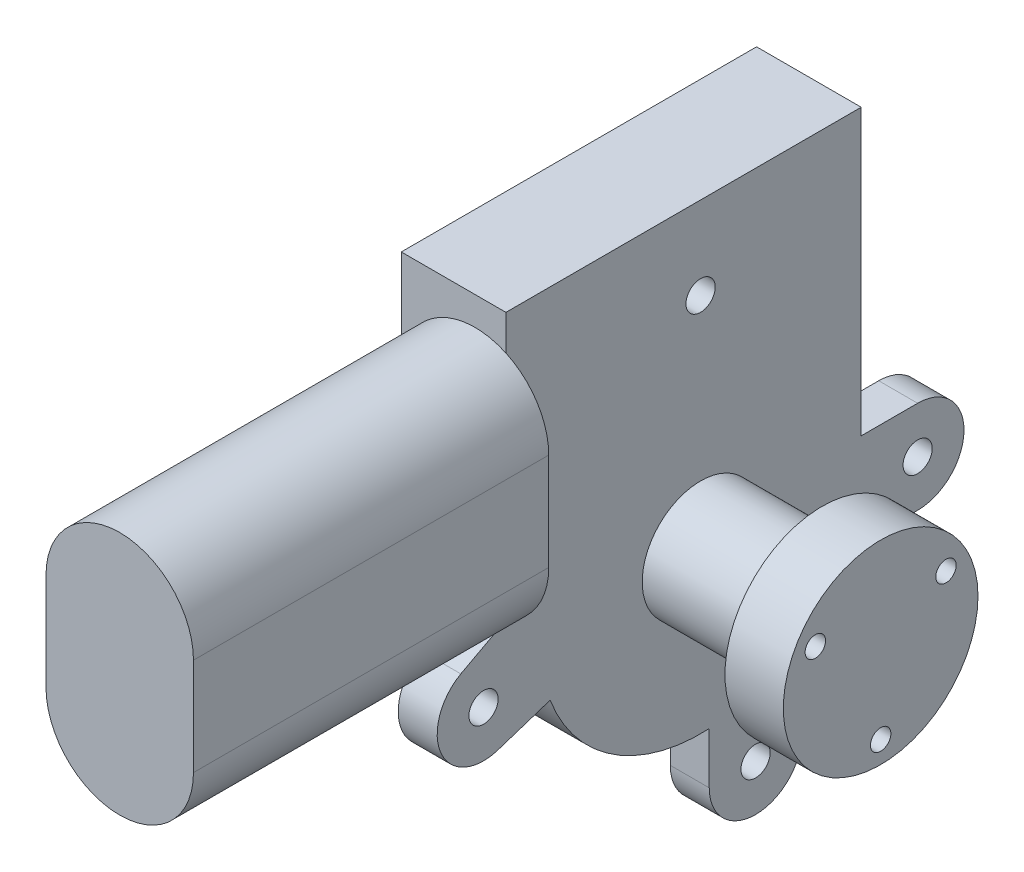
ISO-10303-21;
HEADER;
FILE_DESCRIPTION(('STEP AP214'),'2;1');
FILE_NAME('part.step','',(''),(''),'','','');
FILE_SCHEMA(('AUTOMOTIVE_DESIGN { 1 0 10303 214 1 1 1 1 }'));
ENDSEC;
DATA;
#1=APPLICATION_CONTEXT('core data for automotive mechanical design processes');
#2=APPLICATION_PROTOCOL_DEFINITION('international standard','automotive_design',2000,#1);
#3=PRODUCT_CONTEXT('',#1,'mechanical');
#4=PRODUCT('Part','Part','',(#3));
#5=PRODUCT_RELATED_PRODUCT_CATEGORY('part','',(#4));
#6=PRODUCT_DEFINITION_FORMATION('','',#4);
#7=PRODUCT_DEFINITION_CONTEXT('part definition',#1,'design');
#8=PRODUCT_DEFINITION('design','',#6,#7);
#9=PRODUCT_DEFINITION_SHAPE('','',#8);
#10=(LENGTH_UNIT() NAMED_UNIT(*) SI_UNIT(.MILLI.,.METRE.));
#11=(NAMED_UNIT(*) PLANE_ANGLE_UNIT() SI_UNIT($,.RADIAN.));
#12=(NAMED_UNIT(*) SI_UNIT($,.STERADIAN.) SOLID_ANGLE_UNIT());
#13=UNCERTAINTY_MEASURE_WITH_UNIT(LENGTH_MEASURE(1.E-05),#10,'distance_accuracy_value','');
#14=(GEOMETRIC_REPRESENTATION_CONTEXT(3) GLOBAL_UNCERTAINTY_ASSIGNED_CONTEXT((#13)) GLOBAL_UNIT_ASSIGNED_CONTEXT((#10,
#11,#12)) REPRESENTATION_CONTEXT('',''));
#15=CARTESIAN_POINT('',(0.,0.,0.));
#16=DIRECTION('',(0.,0.,1.));
#17=DIRECTION('',(1.,0.,0.));
#18=AXIS2_PLACEMENT_3D('',#15,#16,#17);
#19=CARTESIAN_POINT('',(0.,0.,73.));
#20=DIRECTION('',(0.,1.,0.));
#21=DIRECTION('',(0.,0.,1.));
#22=AXIS2_PLACEMENT_3D('',#19,#20,#21);
#23=PLANE('',#22);
#24=DIRECTION('',(0.,0.,-1.));
#25=VECTOR('',#24,1.);
#26=CARTESIAN_POINT('',(13.5,0.,73.));
#27=LINE('',#26,#25);
#28=CARTESIAN_POINT('',(13.5,0.,73.));
#29=VERTEX_POINT('',#28);
#30=CARTESIAN_POINT('',(13.5,0.,66.));
#31=VERTEX_POINT('',#30);
#32=EDGE_CURVE('E247',#29,#31,#27,.T.);
#33=ORIENTED_EDGE('',*,*,#32,.F.);
#34=DIRECTION('',(1.,0.,0.));
#35=VECTOR('',#34,1.);
#36=CARTESIAN_POINT('',(0.,0.,73.));
#37=LINE('',#36,#35);
#38=CARTESIAN_POINT('',(0.,0.,73.));
#39=VERTEX_POINT('',#38);
#40=EDGE_CURVE('E341',#39,#29,#37,.T.);
#41=ORIENTED_EDGE('',*,*,#40,.F.);
#42=DIRECTION('',(0.,0.,-1.));
#43=VECTOR('',#42,1.);
#44=CARTESIAN_POINT('',(0.,0.,73.));
#45=LINE('',#44,#43);
#46=CARTESIAN_POINT('',(0.,0.,66.));
#47=VERTEX_POINT('',#46);
#48=EDGE_CURVE('E365',#39,#47,#45,.T.);
#49=ORIENTED_EDGE('',*,*,#48,.T.);
#50=DIRECTION('',(-1.,0.,0.));
#51=VECTOR('',#50,1.);
#52=CARTESIAN_POINT('',(21.5,0.,66.));
#53=LINE('',#52,#51);
#54=EDGE_CURVE('E368',#47,#31,#53,.F.);
#55=ORIENTED_EDGE('',*,*,#54,.T.);
#56=EDGE_LOOP('',(#33,#41,#49,#55));
#57=FACE_BOUND('',#56,.T.);
#58=ADVANCED_FACE('F39',(#57),#23,.F.);
#59=CARTESIAN_POINT('',(0.,0.,73.));
#60=DIRECTION('',(0.,0.,-1.));
#61=DIRECTION('',(-1.,0.,0.));
#62=AXIS2_PLACEMENT_3D('',#59,#60,#61);
#63=PLANE('',#62);
#64=DIRECTION('',(0.,-1.,0.));
#65=VECTOR('',#64,1.);
#66=CARTESIAN_POINT('',(13.5,0.,73.));
#67=LINE('',#66,#65);
#68=CARTESIAN_POINT('',(13.5,5.94011952238664,73.));
#69=VERTEX_POINT('',#68);
#70=EDGE_CURVE('E241',#69,#29,#67,.T.);
#71=ORIENTED_EDGE('',*,*,#70,.F.);
#72=CARTESIAN_POINT('',(15.15,21.,73.));
#73=DIRECTION('',(0.,0.,1.));
#74=DIRECTION('',(1.,0.,0.));
#75=AXIS2_PLACEMENT_3D('',#72,#73,#74);
#76=CIRCLE('',#75,15.15);
#77=CARTESIAN_POINT('',(0.,21.,73.));
#78=VERTEX_POINT('',#77);
#79=EDGE_CURVE('E324',#78,#69,#76,.T.);
#80=ORIENTED_EDGE('',*,*,#79,.F.);
#81=DIRECTION('',(0.,-1.,0.));
#82=VECTOR('',#81,1.);
#83=CARTESIAN_POINT('',(0.,0.,73.));
#84=LINE('',#83,#82);
#85=EDGE_CURVE('E342',#78,#39,#84,.T.);
#86=ORIENTED_EDGE('',*,*,#85,.T.);
#87=ORIENTED_EDGE('',*,*,#40,.T.);
#88=EDGE_LOOP('',(#71,#80,#86,#87));
#89=FACE_BOUND('',#88,.T.);
#90=ADVANCED_FACE('F427',(#89),#63,.F.);
#91=CARTESIAN_POINT('',(15.15,41.,73.));
#92=DIRECTION('',(0.,0.,1.));
#93=DIRECTION('',(1.,0.,0.));
#94=AXIS2_PLACEMENT_3D('',#91,#92,#93);
#95=CIRCLE('',#94,15.15);
#96=CARTESIAN_POINT('',(21.5,54.7549990912395,73.));
#97=VERTEX_POINT('',#96);
#98=CARTESIAN_POINT('',(0.,41.,73.));
#99=VERTEX_POINT('',#98);
#100=EDGE_CURVE('E323',#97,#99,#95,.T.);
#101=ORIENTED_EDGE('',*,*,#100,.F.);
#102=DIRECTION('',(0.,1.,0.));
#103=VECTOR('',#102,1.);
#104=CARTESIAN_POINT('',(21.5,0.,73.));
#105=LINE('',#104,#103);
#106=CARTESIAN_POINT('',(21.5,62.,73.));
#107=VERTEX_POINT('',#106);
#108=EDGE_CURVE('E345',#97,#107,#105,.T.);
#109=ORIENTED_EDGE('',*,*,#108,.T.);
#110=DIRECTION('',(-1.,0.,0.));
#111=VECTOR('',#110,1.);
#112=CARTESIAN_POINT('',(0.,62.,73.));
#113=LINE('',#112,#111);
#114=CARTESIAN_POINT('',(0.,62.,73.));
#115=VERTEX_POINT('',#114);
#116=EDGE_CURVE('E348',#107,#115,#113,.T.);
#117=ORIENTED_EDGE('',*,*,#116,.T.);
#118=EDGE_CURVE('E339',#115,#99,#84,.T.);
#119=ORIENTED_EDGE('',*,*,#118,.T.);
#120=EDGE_LOOP('',(#101,#109,#117,#119));
#121=FACE_BOUND('',#120,.T.);
#122=ADVANCED_FACE('F449',(#121),#63,.F.);
#123=CARTESIAN_POINT('',(21.5,0.,33.));
#124=DIRECTION('',(-1.,0.,0.));
#125=DIRECTION('',(0.,0.,1.));
#126=AXIS2_PLACEMENT_3D('',#123,#124,#125);
#127=CYLINDRICAL_SURFACE('',#126,33.);
#128=CARTESIAN_POINT('',(21.5,0.,33.));
#129=DIRECTION('',(1.,0.,0.));
#130=DIRECTION('',(0.,0.,-1.));
#131=AXIS2_PLACEMENT_3D('',#128,#129,#130);
#132=CIRCLE('',#131,33.);
#133=CARTESIAN_POINT('',(21.5,-11.5557475374894,63.9105920171356));
#134=VERTEX_POINT('',#133);
#135=CARTESIAN_POINT('',(21.5,-32.9522286803184,31.225));
#136=VERTEX_POINT('',#135);
#137=EDGE_CURVE('E60',#134,#136,#132,.T.);
#138=ORIENTED_EDGE('',*,*,#137,.F.);
#139=DIRECTION('',(1.,0.,0.));
#140=VECTOR('',#139,1.);
#141=CARTESIAN_POINT('',(13.5,-11.5557475374894,63.9105920171356));
#142=LINE('',#141,#140);
#143=CARTESIAN_POINT('',(13.5,-11.5557475374894,63.9105920171356));
#144=VERTEX_POINT('',#143);
#145=EDGE_CURVE('E55',#144,#134,#142,.T.);
#146=ORIENTED_EDGE('',*,*,#145,.F.);
#147=CARTESIAN_POINT('',(13.5,0.,33.));
#148=DIRECTION('',(1.,0.,0.));
#149=DIRECTION('',(0.,0.,-1.));
#150=AXIS2_PLACEMENT_3D('',#147,#148,#149);
#151=CIRCLE('',#150,33.);
#152=EDGE_CURVE('E250',#31,#144,#151,.T.);
#153=ORIENTED_EDGE('',*,*,#152,.F.);
#154=ORIENTED_EDGE('',*,*,#54,.F.);
#155=CARTESIAN_POINT('',(0.,0.,33.));
#156=DIRECTION('',(1.,0.,0.));
#157=DIRECTION('',(0.,0.,-1.));
#158=AXIS2_PLACEMENT_3D('',#155,#156,#157);
#159=CIRCLE('',#158,33.);
#160=CARTESIAN_POINT('',(0.,0.,0.));
#161=VERTEX_POINT('',#160);
#162=EDGE_CURVE('E374',#47,#161,#159,.T.);
#163=ORIENTED_EDGE('',*,*,#162,.T.);
#164=DIRECTION('',(1.,0.,0.));
#165=VECTOR('',#164,1.);
#166=CARTESIAN_POINT('',(0.,0.,0.));
#167=LINE('',#166,#165);
#168=CARTESIAN_POINT('',(13.5,0.,0.));
#169=VERTEX_POINT('',#168);
#170=EDGE_CURVE('E353',#161,#169,#167,.T.);
#171=ORIENTED_EDGE('',*,*,#170,.T.);
#172=CARTESIAN_POINT('',(13.5,0.,33.));
#173=DIRECTION('',(-1.,0.,0.));
#174=DIRECTION('',(0.,0.,1.));
#175=AXIS2_PLACEMENT_3D('',#172,#173,#174);
#176=CIRCLE('',#175,33.);
#177=CARTESIAN_POINT('',(13.5,-15.525,3.88000042925825));
#178=VERTEX_POINT('',#177);
#179=EDGE_CURVE('E298',#169,#178,#176,.T.);
#180=ORIENTED_EDGE('',*,*,#179,.T.);
#181=DIRECTION('',(1.,0.,0.));
#182=VECTOR('',#181,1.);
#183=CARTESIAN_POINT('',(13.5,-15.525,3.88000042925825));
#184=LINE('',#183,#182);
#185=CARTESIAN_POINT('',(21.5,-15.525,3.88000042925825));
#186=VERTEX_POINT('',#185);
#187=EDGE_CURVE('E299',#178,#186,#184,.T.);
#188=ORIENTED_EDGE('',*,*,#187,.T.);
#189=CARTESIAN_POINT('',(21.5,-25.599206530672,12.175));
#190=VERTEX_POINT('',#189);
#191=EDGE_CURVE('E376',#190,#186,#132,.T.);
#192=ORIENTED_EDGE('',*,*,#191,.F.);
#193=DIRECTION('',(1.,0.,0.));
#194=VECTOR('',#193,1.);
#195=CARTESIAN_POINT('',(13.5,-25.599206530672,12.175));
#196=LINE('',#195,#194);
#197=CARTESIAN_POINT('',(13.5,-25.599206530672,12.175));
#198=VERTEX_POINT('',#197);
#199=EDGE_CURVE('E275',#198,#190,#196,.T.);
#200=ORIENTED_EDGE('',*,*,#199,.F.);
#201=CARTESIAN_POINT('',(13.5,0.,33.));
#202=DIRECTION('',(-1.,0.,0.));
#203=DIRECTION('',(0.,0.,1.));
#204=AXIS2_PLACEMENT_3D('',#201,#202,#203);
#205=CIRCLE('',#204,33.);
#206=CARTESIAN_POINT('',(13.5,-32.9522286803184,31.225));
#207=VERTEX_POINT('',#206);
#208=EDGE_CURVE('E380',#198,#207,#205,.T.);
#209=ORIENTED_EDGE('',*,*,#208,.T.);
#210=DIRECTION('',(1.,0.,0.));
#211=VECTOR('',#210,1.);
#212=CARTESIAN_POINT('',(13.5,-32.9522286803184,31.225));
#213=LINE('',#212,#211);
#214=EDGE_CURVE('E273',#207,#136,#213,.T.);
#215=ORIENTED_EDGE('',*,*,#214,.T.);
#216=EDGE_LOOP('',(#138,#146,#153,#154,#163,#171,#180,#188,#192,#200,#209,#215));
#217=FACE_BOUND('',#216,.T.);
#218=ADVANCED_FACE('F41',(#217),#127,.T.);
#219=CARTESIAN_POINT('',(21.5,0.,33.));
#220=DIRECTION('',(1.,0.,0.));
#221=DIRECTION('',(0.,0.,-1.));
#222=AXIS2_PLACEMENT_3D('',#219,#220,#221);
#223=PLANE('',#222);
#224=CARTESIAN_POINT('',(21.5,45.,33.));
#225=DIRECTION('',(1.,0.,0.));
#226=DIRECTION('',(0.,0.,-1.));
#227=AXIS2_PLACEMENT_3D('',#224,#225,#226);
#228=CIRCLE('',#227,3.);
#229=CARTESIAN_POINT('',(21.5,45.,30.));
#230=VERTEX_POINT('',#229);
#231=EDGE_CURVE('E885',#230,#230,#228,.T.);
#232=ORIENTED_EDGE('',*,*,#231,.F.);
#233=EDGE_LOOP('',(#232));
#234=FACE_BOUND('',#233,.T.);
#235=CARTESIAN_POINT('',(21.5,-6.,-11.6));
#236=DIRECTION('',(1.,0.,0.));
#237=DIRECTION('',(0.,0.,-1.));
#238=AXIS2_PLACEMENT_3D('',#235,#236,#237);
#239=CIRCLE('',#238,3.);
#240=CARTESIAN_POINT('',(21.5,-6.,-14.6));
#241=VERTEX_POINT('',#240);
#242=EDGE_CURVE('E197',#241,#241,#239,.T.);
#243=ORIENTED_EDGE('',*,*,#242,.F.);
#244=EDGE_LOOP('',(#243));
#245=FACE_BOUND('',#244,.T.);
#246=CARTESIAN_POINT('',(21.5,-43.5,21.7));
#247=DIRECTION('',(1.,0.,0.));
#248=DIRECTION('',(0.,0.,-1.));
#249=AXIS2_PLACEMENT_3D('',#246,#247,#248);
#250=CIRCLE('',#249,3.);
#251=CARTESIAN_POINT('',(21.5,-43.5,18.7));
#252=VERTEX_POINT('',#251);
#253=EDGE_CURVE('E210',#252,#252,#250,.T.);
#254=ORIENTED_EDGE('',*,*,#253,.F.);
#255=EDGE_LOOP('',(#254));
#256=FACE_BOUND('',#255,.T.);
#257=CARTESIAN_POINT('',(21.5,-6.,77.6));
#258=DIRECTION('',(1.,0.,0.));
#259=DIRECTION('',(0.,0.,-1.));
#260=AXIS2_PLACEMENT_3D('',#257,#258,#259);
#261=CIRCLE('',#260,3.);
#262=CARTESIAN_POINT('',(21.5,-6.,74.6));
#263=VERTEX_POINT('',#262);
#264=EDGE_CURVE('E216',#263,#263,#261,.T.);
#265=ORIENTED_EDGE('',*,*,#264,.F.);
#266=EDGE_LOOP('',(#265));
#267=FACE_BOUND('',#266,.T.);
#268=DIRECTION('',(0.,0.309935279373461,-0.950757657134401));
#269=VECTOR('',#268,1.);
#270=CARTESIAN_POINT('',(21.5,-15.0559666842052,74.6478664639678));
#271=LINE('',#270,#269);
#272=CARTESIAN_POINT('',(21.5,-15.0559666842052,74.6478664639678));
#273=VERTEX_POINT('',#272);
#274=EDGE_CURVE('E226',#273,#134,#271,.T.);
#275=ORIENTED_EDGE('',*,*,#274,.T.);
#276=ORIENTED_EDGE('',*,*,#137,.T.);
#277=DIRECTION('',(0.,-1.,0.));
#278=VECTOR('',#277,1.);
#279=CARTESIAN_POINT('',(21.5,-32.9522286803184,31.225));
#280=LINE('',#279,#278);
#281=CARTESIAN_POINT('',(21.5,-43.5,31.225));
#282=VERTEX_POINT('',#281);
#283=EDGE_CURVE('E257',#136,#282,#280,.T.);
#284=ORIENTED_EDGE('',*,*,#283,.T.);
#285=CARTESIAN_POINT('',(21.5,-43.5,21.7));
#286=DIRECTION('',(1.,0.,0.));
#287=DIRECTION('',(0.,0.,1.));
#288=AXIS2_PLACEMENT_3D('',#285,#286,#287);
#289=CIRCLE('',#288,9.525);
#290=CARTESIAN_POINT('',(21.5,-43.5,12.175));
#291=VERTEX_POINT('',#290);
#292=EDGE_CURVE('E252',#282,#291,#289,.T.);
#293=ORIENTED_EDGE('',*,*,#292,.T.);
#294=DIRECTION('',(0.,1.,0.));
#295=VECTOR('',#294,1.);
#296=CARTESIAN_POINT('',(21.5,-43.5,12.175));
#297=LINE('',#296,#295);
#298=EDGE_CURVE('E266',#291,#190,#297,.T.);
#299=ORIENTED_EDGE('',*,*,#298,.T.);
#300=ORIENTED_EDGE('',*,*,#191,.T.);
#301=DIRECTION('',(0.,0.,-1.));
#302=VECTOR('',#301,1.);
#303=CARTESIAN_POINT('',(21.5,-15.525,-11.6));
#304=LINE('',#303,#302);
#305=CARTESIAN_POINT('',(21.5,-15.525,-11.6));
#306=VERTEX_POINT('',#305);
#307=EDGE_CURVE('E283',#186,#306,#304,.T.);
#308=ORIENTED_EDGE('',*,*,#307,.T.);
#309=CARTESIAN_POINT('',(21.5,-6.,-11.6));
#310=DIRECTION('',(1.,0.,0.));
#311=DIRECTION('',(0.,0.,1.));
#312=AXIS2_PLACEMENT_3D('',#309,#310,#311);
#313=CIRCLE('',#312,9.525);
#314=CARTESIAN_POINT('',(21.5,3.525,-11.6));
#315=VERTEX_POINT('',#314);
#316=EDGE_CURVE('E272',#306,#315,#313,.T.);
#317=ORIENTED_EDGE('',*,*,#316,.T.);
#318=DIRECTION('',(0.,0.,1.));
#319=VECTOR('',#318,1.);
#320=CARTESIAN_POINT('',(21.5,3.525,-11.6));
#321=LINE('',#320,#319);
#322=CARTESIAN_POINT('',(21.5,3.525,0.));
#323=VERTEX_POINT('',#322);
#324=EDGE_CURVE('E292',#315,#323,#321,.T.);
#325=ORIENTED_EDGE('',*,*,#324,.T.);
#326=DIRECTION('',(0.,1.,0.));
#327=VECTOR('',#326,1.);
#328=CARTESIAN_POINT('',(21.5,0.,0.));
#329=LINE('',#328,#327);
#330=CARTESIAN_POINT('',(21.5,62.,0.));
#331=VERTEX_POINT('',#330);
#332=EDGE_CURVE('E356',#323,#331,#329,.T.);
#333=ORIENTED_EDGE('',*,*,#332,.T.);
#334=DIRECTION('',(0.,0.,-1.));
#335=VECTOR('',#334,1.);
#336=CARTESIAN_POINT('',(21.5,62.,73.));
#337=LINE('',#336,#335);
#338=EDGE_CURVE('E362',#107,#331,#337,.T.);
#339=ORIENTED_EDGE('',*,*,#338,.F.);
#340=ORIENTED_EDGE('',*,*,#108,.F.);
#341=CARTESIAN_POINT('',(21.5,7.24500090876047,73.));
#342=VERTEX_POINT('',#341);
#343=EDGE_CURVE('E347',#342,#97,#105,.T.);
#344=ORIENTED_EDGE('',*,*,#343,.F.);
#345=DIRECTION('',(0.,-0.470542180058905,0.882377502424791));
#346=VECTOR('',#345,1.);
#347=CARTESIAN_POINT('',(21.5,2.30185189333814,82.269569588418));
#348=LINE('',#347,#346);
#349=CARTESIAN_POINT('',(21.5,2.30185189333814,82.269569588418));
#350=VERTEX_POINT('',#349);
#351=EDGE_CURVE('E222',#342,#350,#348,.T.);
#352=ORIENTED_EDGE('',*,*,#351,.T.);
#353=CARTESIAN_POINT('',(21.5,-6.,77.6));
#354=DIRECTION('',(1.,0.,0.));
#355=DIRECTION('',(0.,0.,-1.));
#356=AXIS2_PLACEMENT_3D('',#353,#354,#355);
#357=CIRCLE('',#356,9.525);
#358=EDGE_CURVE('E235',#350,#273,#357,.T.);
#359=ORIENTED_EDGE('',*,*,#358,.T.);
#360=EDGE_LOOP('',(#275,#276,#284,#293,#299,#300,#308,#317,#325,#333,#339,#340,#344,#352,#359));
#361=FACE_BOUND('',#360,.T.);
#362=CARTESIAN_POINT('',(21.5,0.,33.));
#363=DIRECTION('',(1.,0.,0.));
#364=DIRECTION('',(0.,0.,-1.));
#365=AXIS2_PLACEMENT_3D('',#362,#363,#364);
#366=CIRCLE('',#365,12.);
#367=CARTESIAN_POINT('',(21.5,0.,21.));
#368=VERTEX_POINT('',#367);
#369=EDGE_CURVE('E910',#368,#368,#366,.T.);
#370=ORIENTED_EDGE('',*,*,#369,.F.);
#371=EDGE_LOOP('',(#370));
#372=FACE_BOUND('',#371,.T.);
#373=ADVANCED_FACE('F399',(#234,#245,#256,#267,#361,#372),#223,.T.);
#374=CARTESIAN_POINT('',(0.,0.,33.));
#375=DIRECTION('',(1.,0.,0.));
#376=DIRECTION('',(0.,0.,-1.));
#377=AXIS2_PLACEMENT_3D('',#374,#375,#376);
#378=PLANE('',#377);
#379=ORIENTED_EDGE('',*,*,#162,.F.);
#380=ORIENTED_EDGE('',*,*,#48,.F.);
#381=ORIENTED_EDGE('',*,*,#85,.F.);
#382=DIRECTION('',(0.,0.,-1.));
#383=VECTOR('',#382,1.);
#384=CARTESIAN_POINT('',(0.,21.,146.));
#385=LINE('',#384,#383);
#386=CARTESIAN_POINT('',(0.,21.,146.));
#387=VERTEX_POINT('',#386);
#388=EDGE_CURVE('E332',#387,#78,#385,.T.);
#389=ORIENTED_EDGE('',*,*,#388,.F.);
#390=DIRECTION('',(0.,-1.,0.));
#391=VECTOR('',#390,1.);
#392=CARTESIAN_POINT('',(0.,41.,146.));
#393=LINE('',#392,#391);
#394=CARTESIAN_POINT('',(0.,41.,146.));
#395=VERTEX_POINT('',#394);
#396=EDGE_CURVE('E312',#395,#387,#393,.T.);
#397=ORIENTED_EDGE('',*,*,#396,.F.);
#398=DIRECTION('',(0.,0.,-1.));
#399=VECTOR('',#398,1.);
#400=CARTESIAN_POINT('',(0.,41.,146.));
#401=LINE('',#400,#399);
#402=EDGE_CURVE('E335',#395,#99,#401,.T.);
#403=ORIENTED_EDGE('',*,*,#402,.T.);
#404=ORIENTED_EDGE('',*,*,#118,.F.);
#405=DIRECTION('',(0.,0.,-1.));
#406=VECTOR('',#405,1.);
#407=CARTESIAN_POINT('',(0.,62.,73.));
#408=LINE('',#407,#406);
#409=CARTESIAN_POINT('',(0.,62.,0.));
#410=VERTEX_POINT('',#409);
#411=EDGE_CURVE('E350',#115,#410,#408,.T.);
#412=ORIENTED_EDGE('',*,*,#411,.T.);
#413=DIRECTION('',(0.,-1.,0.));
#414=VECTOR('',#413,1.);
#415=CARTESIAN_POINT('',(0.,0.,0.));
#416=LINE('',#415,#414);
#417=EDGE_CURVE('E338',#410,#161,#416,.T.);
#418=ORIENTED_EDGE('',*,*,#417,.T.);
#419=EDGE_LOOP('',(#379,#380,#381,#389,#397,#403,#404,#412,#418));
#420=FACE_BOUND('',#419,.T.);
#421=ADVANCED_FACE('F423',(#420),#378,.F.);
#422=CARTESIAN_POINT('',(0.,62.,73.));
#423=DIRECTION('',(0.,-1.,0.));
#424=DIRECTION('',(0.,0.,-1.));
#425=AXIS2_PLACEMENT_3D('',#422,#423,#424);
#426=PLANE('',#425);
#427=DIRECTION('',(-1.,0.,0.));
#428=VECTOR('',#427,1.);
#429=CARTESIAN_POINT('',(0.,62.,0.));
#430=LINE('',#429,#428);
#431=EDGE_CURVE('E358',#331,#410,#430,.T.);
#432=ORIENTED_EDGE('',*,*,#431,.T.);
#433=ORIENTED_EDGE('',*,*,#411,.F.);
#434=ORIENTED_EDGE('',*,*,#116,.F.);
#435=ORIENTED_EDGE('',*,*,#338,.T.);
#436=EDGE_LOOP('',(#432,#433,#434,#435));
#437=FACE_BOUND('',#436,.T.);
#438=ADVANCED_FACE('F453',(#437),#426,.F.);
#439=CARTESIAN_POINT('',(0.,0.,0.));
#440=DIRECTION('',(0.,0.,-1.));
#441=DIRECTION('',(-1.,0.,0.));
#442=AXIS2_PLACEMENT_3D('',#439,#440,#441);
#443=PLANE('',#442);
#444=DIRECTION('',(1.,0.,0.));
#445=VECTOR('',#444,1.);
#446=CARTESIAN_POINT('',(13.5,3.525,0.));
#447=LINE('',#446,#445);
#448=CARTESIAN_POINT('',(13.5,3.525,0.));
#449=VERTEX_POINT('',#448);
#450=EDGE_CURVE('E302',#449,#323,#447,.T.);
#451=ORIENTED_EDGE('',*,*,#450,.F.);
#452=DIRECTION('',(0.,1.,0.));
#453=VECTOR('',#452,1.);
#454=CARTESIAN_POINT('',(13.5,0.,0.));
#455=LINE('',#454,#453);
#456=EDGE_CURVE('E378',#169,#449,#455,.T.);
#457=ORIENTED_EDGE('',*,*,#456,.F.);
#458=ORIENTED_EDGE('',*,*,#170,.F.);
#459=ORIENTED_EDGE('',*,*,#417,.F.);
#460=ORIENTED_EDGE('',*,*,#431,.F.);
#461=ORIENTED_EDGE('',*,*,#332,.F.);
#462=EDGE_LOOP('',(#451,#457,#458,#459,#460,#461));
#463=FACE_BOUND('',#462,.T.);
#464=ADVANCED_FACE('F473',(#463),#443,.T.);
#465=CARTESIAN_POINT('',(15.15,41.,73.));
#466=DIRECTION('',(0.,0.,1.));
#467=DIRECTION('',(1.,0.,0.));
#468=AXIS2_PLACEMENT_3D('',#465,#466,#467);
#469=PLANE('',#468);
#470=CARTESIAN_POINT('',(30.3,21.,73.));
#471=VERTEX_POINT('',#470);
#472=EDGE_CURVE('E322',#342,#471,#76,.T.);
#473=ORIENTED_EDGE('',*,*,#472,.F.);
#474=ORIENTED_EDGE('',*,*,#343,.T.);
#475=CARTESIAN_POINT('',(30.3,41.,73.));
#476=VERTEX_POINT('',#475);
#477=EDGE_CURVE('E308',#476,#97,#95,.T.);
#478=ORIENTED_EDGE('',*,*,#477,.F.);
#479=DIRECTION('',(0.,1.,0.));
#480=VECTOR('',#479,1.);
#481=CARTESIAN_POINT('',(30.3,41.,73.));
#482=LINE('',#481,#480);
#483=EDGE_CURVE('E313',#471,#476,#482,.T.);
#484=ORIENTED_EDGE('',*,*,#483,.F.);
#485=EDGE_LOOP('',(#473,#474,#478,#484));
#486=FACE_BOUND('',#485,.T.);
#487=ADVANCED_FACE('F408',(#486),#469,.F.);
#488=CARTESIAN_POINT('',(15.15,41.,146.));
#489=DIRECTION('',(0.,0.,-1.));
#490=DIRECTION('',(-1.,0.,0.));
#491=AXIS2_PLACEMENT_3D('',#488,#489,#490);
#492=CYLINDRICAL_SURFACE('',#491,15.15);
#493=ORIENTED_EDGE('',*,*,#477,.T.);
#494=ORIENTED_EDGE('',*,*,#100,.T.);
#495=ORIENTED_EDGE('',*,*,#402,.F.);
#496=CARTESIAN_POINT('',(15.15,41.,146.));
#497=DIRECTION('',(0.,0.,1.));
#498=DIRECTION('',(1.,0.,0.));
#499=AXIS2_PLACEMENT_3D('',#496,#497,#498);
#500=CIRCLE('',#499,15.15);
#501=CARTESIAN_POINT('',(30.3,41.,146.));
#502=VERTEX_POINT('',#501);
#503=EDGE_CURVE('E309',#502,#395,#500,.T.);
#504=ORIENTED_EDGE('',*,*,#503,.F.);
#505=DIRECTION('',(0.,0.,-1.));
#506=VECTOR('',#505,1.);
#507=CARTESIAN_POINT('',(30.3,41.,146.));
#508=LINE('',#507,#506);
#509=EDGE_CURVE('E319',#502,#476,#508,.T.);
#510=ORIENTED_EDGE('',*,*,#509,.T.);
#511=EDGE_LOOP('',(#493,#494,#495,#504,#510));
#512=FACE_BOUND('',#511,.T.);
#513=ADVANCED_FACE('F540',(#512),#492,.T.);
#514=CARTESIAN_POINT('',(15.15,21.,146.));
#515=DIRECTION('',(0.,0.,-1.));
#516=DIRECTION('',(-1.,0.,0.));
#517=AXIS2_PLACEMENT_3D('',#514,#515,#516);
#518=CYLINDRICAL_SURFACE('',#517,15.15);
#519=DIRECTION('',(0.,0.,-1.));
#520=VECTOR('',#519,1.);
#521=CARTESIAN_POINT('',(13.5,5.94011952238664,146.));
#522=LINE('',#521,#520);
#523=CARTESIAN_POINT('',(13.5,5.94011952238664,75.4469601822413));
#524=VERTEX_POINT('',#523);
#525=EDGE_CURVE('E48',#524,#69,#522,.T.);
#526=ORIENTED_EDGE('',*,*,#525,.F.);
#527=CARTESIAN_POINT('',(15.15,21.,47.2061344161244));
#528=DIRECTION('',(0.,0.882377502424791,0.470542180058905));
#529=DIRECTION('',(0.,0.470542180058905,-0.882377502424791));
#530=AXIS2_PLACEMENT_3D('',#527,#528,#529);
#531=ELLIPSE('',#530,32.196901026181,15.15);
#532=EDGE_CURVE('E11',#524,#342,#531,.T.);
#533=ORIENTED_EDGE('',*,*,#532,.T.);
#534=ORIENTED_EDGE('',*,*,#472,.T.);
#535=DIRECTION('',(0.,0.,-1.));
#536=VECTOR('',#535,1.);
#537=CARTESIAN_POINT('',(30.3,21.,146.));
#538=LINE('',#537,#536);
#539=CARTESIAN_POINT('',(30.3,21.,146.));
#540=VERTEX_POINT('',#539);
#541=EDGE_CURVE('E329',#540,#471,#538,.T.);
#542=ORIENTED_EDGE('',*,*,#541,.F.);
#543=CARTESIAN_POINT('',(15.15,21.,146.));
#544=DIRECTION('',(0.,0.,1.));
#545=DIRECTION('',(1.,0.,0.));
#546=AXIS2_PLACEMENT_3D('',#543,#544,#545);
#547=CIRCLE('',#546,15.15);
#548=EDGE_CURVE('E315',#387,#540,#547,.T.);
#549=ORIENTED_EDGE('',*,*,#548,.F.);
#550=ORIENTED_EDGE('',*,*,#388,.T.);
#551=ORIENTED_EDGE('',*,*,#79,.T.);
#552=EDGE_LOOP('',(#526,#533,#534,#542,#549,#550,#551));
#553=FACE_BOUND('',#552,.T.);
#554=ADVANCED_FACE('F391',(#553),#518,.T.);
#555=CARTESIAN_POINT('',(30.3,41.,146.));
#556=DIRECTION('',(-1.,0.,0.));
#557=DIRECTION('',(0.,0.,1.));
#558=AXIS2_PLACEMENT_3D('',#555,#556,#557);
#559=PLANE('',#558);
#560=ORIENTED_EDGE('',*,*,#483,.T.);
#561=ORIENTED_EDGE('',*,*,#509,.F.);
#562=DIRECTION('',(0.,1.,0.));
#563=VECTOR('',#562,1.);
#564=CARTESIAN_POINT('',(30.3,41.,146.));
#565=LINE('',#564,#563);
#566=EDGE_CURVE('E317',#540,#502,#565,.T.);
#567=ORIENTED_EDGE('',*,*,#566,.F.);
#568=ORIENTED_EDGE('',*,*,#541,.T.);
#569=EDGE_LOOP('',(#560,#561,#567,#568));
#570=FACE_BOUND('',#569,.T.);
#571=ADVANCED_FACE('F413',(#570),#559,.F.);
#572=CARTESIAN_POINT('',(15.15,41.,146.));
#573=DIRECTION('',(0.,0.,1.));
#574=DIRECTION('',(1.,0.,0.));
#575=AXIS2_PLACEMENT_3D('',#572,#573,#574);
#576=PLANE('',#575);
#577=ORIENTED_EDGE('',*,*,#503,.T.);
#578=ORIENTED_EDGE('',*,*,#396,.T.);
#579=ORIENTED_EDGE('',*,*,#548,.T.);
#580=ORIENTED_EDGE('',*,*,#566,.T.);
#581=EDGE_LOOP('',(#577,#578,#579,#580));
#582=FACE_BOUND('',#581,.T.);
#583=ADVANCED_FACE('F417',(#582),#576,.T.);
#584=CARTESIAN_POINT('',(13.5,-6.,-11.6));
#585=DIRECTION('',(-1.,0.,0.));
#586=DIRECTION('',(0.,0.,1.));
#587=AXIS2_PLACEMENT_3D('',#584,#585,#586);
#588=PLANE('',#587);
#589=CARTESIAN_POINT('',(13.5,-6.,-11.6));
#590=DIRECTION('',(-1.,0.,0.));
#591=DIRECTION('',(0.,0.,1.));
#592=AXIS2_PLACEMENT_3D('',#589,#590,#591);
#593=CIRCLE('',#592,3.);
#594=CARTESIAN_POINT('',(13.5,-6.,-8.6));
#595=VERTEX_POINT('',#594);
#596=EDGE_CURVE('E201',#595,#595,#593,.T.);
#597=ORIENTED_EDGE('',*,*,#596,.F.);
#598=EDGE_LOOP('',(#597));
#599=FACE_BOUND('',#598,.T.);
#600=ORIENTED_EDGE('',*,*,#179,.F.);
#601=ORIENTED_EDGE('',*,*,#456,.T.);
#602=DIRECTION('',(0.,0.,1.));
#603=VECTOR('',#602,1.);
#604=CARTESIAN_POINT('',(13.5,3.525,-11.6));
#605=LINE('',#604,#603);
#606=CARTESIAN_POINT('',(13.5,3.525,-11.6));
#607=VERTEX_POINT('',#606);
#608=EDGE_CURVE('E282',#607,#449,#605,.T.);
#609=ORIENTED_EDGE('',*,*,#608,.F.);
#610=CARTESIAN_POINT('',(13.5,-6.,-11.6));
#611=DIRECTION('',(1.,0.,0.));
#612=DIRECTION('',(0.,0.,1.));
#613=AXIS2_PLACEMENT_3D('',#610,#611,#612);
#614=CIRCLE('',#613,9.525);
#615=CARTESIAN_POINT('',(13.5,-15.525,-11.6));
#616=VERTEX_POINT('',#615);
#617=EDGE_CURVE('E279',#616,#607,#614,.T.);
#618=ORIENTED_EDGE('',*,*,#617,.F.);
#619=DIRECTION('',(0.,0.,-1.));
#620=VECTOR('',#619,1.);
#621=CARTESIAN_POINT('',(13.5,-15.525,-11.6));
#622=LINE('',#621,#620);
#623=EDGE_CURVE('E286',#178,#616,#622,.T.);
#624=ORIENTED_EDGE('',*,*,#623,.F.);
#625=EDGE_LOOP('',(#600,#601,#609,#618,#624));
#626=FACE_BOUND('',#625,.T.);
#627=ADVANCED_FACE('F491',(#599,#626),#588,.T.);
#628=CARTESIAN_POINT('',(13.5,-6.,-11.6));
#629=DIRECTION('',(1.,0.,0.));
#630=DIRECTION('',(0.,0.,-1.));
#631=AXIS2_PLACEMENT_3D('',#628,#629,#630);
#632=CYLINDRICAL_SURFACE('',#631,9.525);
#633=ORIENTED_EDGE('',*,*,#316,.F.);
#634=DIRECTION('',(1.,0.,0.));
#635=VECTOR('',#634,1.);
#636=CARTESIAN_POINT('',(13.5,-15.525,-11.6));
#637=LINE('',#636,#635);
#638=EDGE_CURVE('E296',#616,#306,#637,.T.);
#639=ORIENTED_EDGE('',*,*,#638,.F.);
#640=ORIENTED_EDGE('',*,*,#617,.T.);
#641=DIRECTION('',(1.,0.,0.));
#642=VECTOR('',#641,1.);
#643=CARTESIAN_POINT('',(13.5,3.525,-11.6));
#644=LINE('',#643,#642);
#645=EDGE_CURVE('E289',#607,#315,#644,.T.);
#646=ORIENTED_EDGE('',*,*,#645,.T.);
#647=EDGE_LOOP('',(#633,#639,#640,#646));
#648=FACE_BOUND('',#647,.T.);
#649=ADVANCED_FACE('F526',(#648),#632,.T.);
#650=CARTESIAN_POINT('',(13.5,-15.525,-11.6));
#651=DIRECTION('',(0.,-1.,0.));
#652=DIRECTION('',(0.,0.,-1.));
#653=AXIS2_PLACEMENT_3D('',#650,#651,#652);
#654=PLANE('',#653);
#655=ORIENTED_EDGE('',*,*,#307,.F.);
#656=ORIENTED_EDGE('',*,*,#187,.F.);
#657=ORIENTED_EDGE('',*,*,#623,.T.);
#658=ORIENTED_EDGE('',*,*,#638,.T.);
#659=EDGE_LOOP('',(#655,#656,#657,#658));
#660=FACE_BOUND('',#659,.T.);
#661=ADVANCED_FACE('F496',(#660),#654,.T.);
#662=CARTESIAN_POINT('',(13.5,3.525,-11.6));
#663=DIRECTION('',(0.,1.,0.));
#664=DIRECTION('',(0.,0.,1.));
#665=AXIS2_PLACEMENT_3D('',#662,#663,#664);
#666=PLANE('',#665);
#667=ORIENTED_EDGE('',*,*,#324,.F.);
#668=ORIENTED_EDGE('',*,*,#645,.F.);
#669=ORIENTED_EDGE('',*,*,#608,.T.);
#670=ORIENTED_EDGE('',*,*,#450,.T.);
#671=EDGE_LOOP('',(#667,#668,#669,#670));
#672=FACE_BOUND('',#671,.T.);
#673=ADVANCED_FACE('F520',(#672),#666,.T.);
#674=CARTESIAN_POINT('',(13.5,-43.5,21.7));
#675=DIRECTION('',(1.,0.,0.));
#676=DIRECTION('',(0.,0.,-1.));
#677=AXIS2_PLACEMENT_3D('',#674,#675,#676);
#678=CYLINDRICAL_SURFACE('',#677,9.525);
#679=ORIENTED_EDGE('',*,*,#292,.F.);
#680=DIRECTION('',(1.,0.,0.));
#681=VECTOR('',#680,1.);
#682=CARTESIAN_POINT('',(13.5,-43.5,31.225));
#683=LINE('',#682,#681);
#684=CARTESIAN_POINT('',(13.5,-43.5,31.225));
#685=VERTEX_POINT('',#684);
#686=EDGE_CURVE('E270',#685,#282,#683,.T.);
#687=ORIENTED_EDGE('',*,*,#686,.F.);
#688=CARTESIAN_POINT('',(13.5,-43.5,21.7));
#689=DIRECTION('',(1.,0.,0.));
#690=DIRECTION('',(0.,0.,1.));
#691=AXIS2_PLACEMENT_3D('',#688,#689,#690);
#692=CIRCLE('',#691,9.525);
#693=CARTESIAN_POINT('',(13.5,-43.5,12.175));
#694=VERTEX_POINT('',#693);
#695=EDGE_CURVE('E253',#685,#694,#692,.T.);
#696=ORIENTED_EDGE('',*,*,#695,.T.);
#697=DIRECTION('',(1.,0.,0.));
#698=VECTOR('',#697,1.);
#699=CARTESIAN_POINT('',(13.5,-43.5,12.175));
#700=LINE('',#699,#698);
#701=EDGE_CURVE('E263',#694,#291,#700,.T.);
#702=ORIENTED_EDGE('',*,*,#701,.T.);
#703=EDGE_LOOP('',(#679,#687,#696,#702));
#704=FACE_BOUND('',#703,.T.);
#705=ADVANCED_FACE('F509',(#704),#678,.T.);
#706=CARTESIAN_POINT('',(13.5,-32.9522286803184,31.225));
#707=DIRECTION('',(0.,0.,1.));
#708=DIRECTION('',(0.,-1.,0.));
#709=AXIS2_PLACEMENT_3D('',#706,#707,#708);
#710=PLANE('',#709);
#711=ORIENTED_EDGE('',*,*,#283,.F.);
#712=ORIENTED_EDGE('',*,*,#214,.F.);
#713=DIRECTION('',(0.,-1.,0.));
#714=VECTOR('',#713,1.);
#715=CARTESIAN_POINT('',(13.5,-32.9522286803184,31.225));
#716=LINE('',#715,#714);
#717=EDGE_CURVE('E260',#207,#685,#716,.T.);
#718=ORIENTED_EDGE('',*,*,#717,.T.);
#719=ORIENTED_EDGE('',*,*,#686,.T.);
#720=EDGE_LOOP('',(#711,#712,#718,#719));
#721=FACE_BOUND('',#720,.T.);
#722=ADVANCED_FACE('F512',(#721),#710,.T.);
#723=CARTESIAN_POINT('',(13.5,-43.5,12.175));
#724=DIRECTION('',(0.,0.,-1.));
#725=DIRECTION('',(0.,1.,0.));
#726=AXIS2_PLACEMENT_3D('',#723,#724,#725);
#727=PLANE('',#726);
#728=ORIENTED_EDGE('',*,*,#298,.F.);
#729=ORIENTED_EDGE('',*,*,#701,.F.);
#730=DIRECTION('',(0.,1.,0.));
#731=VECTOR('',#730,1.);
#732=CARTESIAN_POINT('',(13.5,-43.5,12.175));
#733=LINE('',#732,#731);
#734=EDGE_CURVE('E256',#694,#198,#733,.T.);
#735=ORIENTED_EDGE('',*,*,#734,.T.);
#736=ORIENTED_EDGE('',*,*,#199,.T.);
#737=EDGE_LOOP('',(#728,#729,#735,#736));
#738=FACE_BOUND('',#737,.T.);
#739=ADVANCED_FACE('F501',(#738),#727,.T.);
#740=CARTESIAN_POINT('',(13.5,-43.5,21.7));
#741=DIRECTION('',(-1.,0.,0.));
#742=DIRECTION('',(0.,0.,1.));
#743=AXIS2_PLACEMENT_3D('',#740,#741,#742);
#744=PLANE('',#743);
#745=CARTESIAN_POINT('',(13.5,-43.5,21.7));
#746=DIRECTION('',(-1.,0.,0.));
#747=DIRECTION('',(0.,0.,1.));
#748=AXIS2_PLACEMENT_3D('',#745,#746,#747);
#749=CIRCLE('',#748,3.);
#750=CARTESIAN_POINT('',(13.5,-43.5,24.7));
#751=VERTEX_POINT('',#750);
#752=EDGE_CURVE('E213',#751,#751,#749,.T.);
#753=ORIENTED_EDGE('',*,*,#752,.F.);
#754=EDGE_LOOP('',(#753));
#755=FACE_BOUND('',#754,.T.);
#756=ORIENTED_EDGE('',*,*,#208,.F.);
#757=ORIENTED_EDGE('',*,*,#734,.F.);
#758=ORIENTED_EDGE('',*,*,#695,.F.);
#759=ORIENTED_EDGE('',*,*,#717,.F.);
#760=EDGE_LOOP('',(#756,#757,#758,#759));
#761=FACE_BOUND('',#760,.T.);
#762=ADVANCED_FACE('F505',(#755,#761),#744,.T.);
#763=CARTESIAN_POINT('',(13.5,-6.,77.6));
#764=DIRECTION('',(1.,0.,0.));
#765=DIRECTION('',(0.,0.,-1.));
#766=AXIS2_PLACEMENT_3D('',#763,#764,#765);
#767=PLANE('',#766);
#768=CARTESIAN_POINT('',(13.5,-6.,77.6));
#769=DIRECTION('',(1.,0.,0.));
#770=DIRECTION('',(0.,0.,-1.));
#771=AXIS2_PLACEMENT_3D('',#768,#769,#770);
#772=CIRCLE('',#771,3.);
#773=CARTESIAN_POINT('',(13.5,-6.,74.6));
#774=VERTEX_POINT('',#773);
#775=EDGE_CURVE('E219',#774,#774,#772,.T.);
#776=ORIENTED_EDGE('',*,*,#775,.T.);
#777=EDGE_LOOP('',(#776));
#778=FACE_BOUND('',#777,.T.);
#779=ORIENTED_EDGE('',*,*,#32,.T.);
#780=ORIENTED_EDGE('',*,*,#152,.T.);
#781=DIRECTION('',(0.,0.309935279373461,-0.950757657134401));
#782=VECTOR('',#781,1.);
#783=CARTESIAN_POINT('',(13.5,-15.0559666842052,74.6478664639678));
#784=LINE('',#783,#782);
#785=CARTESIAN_POINT('',(13.5,-15.0559666842052,74.6478664639678));
#786=VERTEX_POINT('',#785);
#787=EDGE_CURVE('E229',#786,#144,#784,.T.);
#788=ORIENTED_EDGE('',*,*,#787,.F.);
#789=CARTESIAN_POINT('',(13.5,-6.,77.6));
#790=DIRECTION('',(1.,0.,0.));
#791=DIRECTION('',(0.,0.,-1.));
#792=AXIS2_PLACEMENT_3D('',#789,#790,#791);
#793=CIRCLE('',#792,9.525);
#794=CARTESIAN_POINT('',(13.5,2.30185189333814,82.269569588418));
#795=VERTEX_POINT('',#794);
#796=EDGE_CURVE('E225',#795,#786,#793,.T.);
#797=ORIENTED_EDGE('',*,*,#796,.F.);
#798=DIRECTION('',(0.,-0.470542180058905,0.882377502424791));
#799=VECTOR('',#798,1.);
#800=CARTESIAN_POINT('',(13.5,2.30185189333814,82.269569588418));
#801=LINE('',#800,#799);
#802=EDGE_CURVE('E223',#524,#795,#801,.T.);
#803=ORIENTED_EDGE('',*,*,#802,.F.);
#804=ORIENTED_EDGE('',*,*,#525,.T.);
#805=ORIENTED_EDGE('',*,*,#70,.T.);
#806=EDGE_LOOP('',(#779,#780,#788,#797,#803,#804,#805));
#807=FACE_BOUND('',#806,.T.);
#808=ADVANCED_FACE('F386',(#778,#807),#767,.F.);
#809=CARTESIAN_POINT('',(13.5,-15.0559666842052,74.6478664639678));
#810=DIRECTION('',(0.,-0.950757657134401,-0.309935279373461));
#811=DIRECTION('',(0.,0.309935279373461,-0.950757657134401));
#812=AXIS2_PLACEMENT_3D('',#809,#810,#811);
#813=PLANE('',#812);
#814=ORIENTED_EDGE('',*,*,#274,.F.);
#815=DIRECTION('',(1.,0.,0.));
#816=VECTOR('',#815,1.);
#817=CARTESIAN_POINT('',(13.5,-15.0559666842052,74.6478664639678));
#818=LINE('',#817,#816);
#819=EDGE_CURVE('E242',#786,#273,#818,.T.);
#820=ORIENTED_EDGE('',*,*,#819,.F.);
#821=ORIENTED_EDGE('',*,*,#787,.T.);
#822=ORIENTED_EDGE('',*,*,#145,.T.);
#823=EDGE_LOOP('',(#814,#820,#821,#822));
#824=FACE_BOUND('',#823,.T.);
#825=ADVANCED_FACE('F432',(#824),#813,.T.);
#826=CARTESIAN_POINT('',(13.5,-6.,77.6));
#827=DIRECTION('',(1.,0.,0.));
#828=DIRECTION('',(0.,0.,-1.));
#829=AXIS2_PLACEMENT_3D('',#826,#827,#828);
#830=CYLINDRICAL_SURFACE('',#829,9.525);
#831=ORIENTED_EDGE('',*,*,#358,.F.);
#832=DIRECTION('',(1.,0.,0.));
#833=VECTOR('',#832,1.);
#834=CARTESIAN_POINT('',(13.5,2.30185189333814,82.269569588418));
#835=LINE('',#834,#833);
#836=EDGE_CURVE('E232',#795,#350,#835,.T.);
#837=ORIENTED_EDGE('',*,*,#836,.F.);
#838=ORIENTED_EDGE('',*,*,#796,.T.);
#839=ORIENTED_EDGE('',*,*,#819,.T.);
#840=EDGE_LOOP('',(#831,#837,#838,#839));
#841=FACE_BOUND('',#840,.T.);
#842=ADVANCED_FACE('F434',(#841),#830,.T.);
#843=CARTESIAN_POINT('',(13.5,2.30185189333814,82.269569588418));
#844=DIRECTION('',(0.,0.882377502424791,0.470542180058905));
#845=DIRECTION('',(0.,-0.470542180058905,0.882377502424791));
#846=AXIS2_PLACEMENT_3D('',#843,#844,#845);
#847=PLANE('',#846);
#848=ORIENTED_EDGE('',*,*,#532,.F.);
#849=ORIENTED_EDGE('',*,*,#802,.T.);
#850=ORIENTED_EDGE('',*,*,#836,.T.);
#851=ORIENTED_EDGE('',*,*,#351,.F.);
#852=EDGE_LOOP('',(#848,#849,#850,#851));
#853=FACE_BOUND('',#852,.T.);
#854=ADVANCED_FACE('F395',(#853),#847,.T.);
#855=CARTESIAN_POINT('',(21.5,-6.,77.6));
#856=DIRECTION('',(1.,0.,0.));
#857=DIRECTION('',(0.,0.,-1.));
#858=AXIS2_PLACEMENT_3D('',#855,#856,#857);
#859=CYLINDRICAL_SURFACE('',#858,3.);
#860=ORIENTED_EDGE('',*,*,#264,.T.);
#861=EDGE_LOOP('',(#860));
#862=FACE_BOUND('',#861,.T.);
#863=ORIENTED_EDGE('',*,*,#775,.F.);
#864=EDGE_LOOP('',(#863));
#865=FACE_BOUND('',#864,.T.);
#866=ADVANCED_FACE('F441',(#862,#865),#859,.F.);
#867=CARTESIAN_POINT('',(21.5,-43.5,21.7));
#868=DIRECTION('',(1.,0.,0.));
#869=DIRECTION('',(0.,0.,-1.));
#870=AXIS2_PLACEMENT_3D('',#867,#868,#869);
#871=CYLINDRICAL_SURFACE('',#870,3.);
#872=ORIENTED_EDGE('',*,*,#752,.T.);
#873=EDGE_LOOP('',(#872));
#874=FACE_BOUND('',#873,.T.);
#875=ORIENTED_EDGE('',*,*,#253,.T.);
#876=EDGE_LOOP('',(#875));
#877=FACE_BOUND('',#876,.T.);
#878=ADVANCED_FACE('F673',(#874,#877),#871,.F.);
#879=CARTESIAN_POINT('',(21.5,-6.,-11.6));
#880=DIRECTION('',(1.,0.,0.));
#881=DIRECTION('',(0.,0.,-1.));
#882=AXIS2_PLACEMENT_3D('',#879,#880,#881);
#883=CYLINDRICAL_SURFACE('',#882,3.);
#884=ORIENTED_EDGE('',*,*,#596,.T.);
#885=EDGE_LOOP('',(#884));
#886=FACE_BOUND('',#885,.T.);
#887=ORIENTED_EDGE('',*,*,#242,.T.);
#888=EDGE_LOOP('',(#887));
#889=FACE_BOUND('',#888,.T.);
#890=ADVANCED_FACE('F191',(#886,#889),#883,.F.);
#891=CARTESIAN_POINT('',(6.51,45.,33.));
#892=DIRECTION('',(1.,0.,0.));
#893=DIRECTION('',(0.,0.,-1.));
#894=AXIS2_PLACEMENT_3D('',#891,#892,#893);
#895=CONICAL_SURFACE('',#894,2.5,1.02974425867665);
#896=CARTESIAN_POINT('',(5.00784845243109,45.,33.));
#897=VERTEX_POINT('',#896);
#898=VERTEX_LOOP('',#897);
#899=FACE_BOUND('',#898,.T.);
#900=CARTESIAN_POINT('',(6.51,45.,33.));
#901=DIRECTION('',(1.,0.,0.));
#902=DIRECTION('',(0.,0.,-1.));
#903=AXIS2_PLACEMENT_3D('',#900,#901,#902);
#904=CIRCLE('',#903,2.5);
#905=CARTESIAN_POINT('',(6.51,45.,30.5));
#906=VERTEX_POINT('',#905);
#907=EDGE_CURVE('E195',#906,#906,#904,.T.);
#908=ORIENTED_EDGE('',*,*,#907,.T.);
#909=EDGE_LOOP('',(#908));
#910=FACE_BOUND('',#909,.T.);
#911=ADVANCED_FACE('F187',(#899,#910),#895,.F.);
#912=CARTESIAN_POINT('',(21.5,45.,33.));
#913=DIRECTION('',(1.,0.,0.));
#914=DIRECTION('',(0.,0.,-1.));
#915=AXIS2_PLACEMENT_3D('',#912,#913,#914);
#916=CYLINDRICAL_SURFACE('',#915,2.5);
#917=ORIENTED_EDGE('',*,*,#907,.F.);
#918=EDGE_LOOP('',(#917));
#919=FACE_BOUND('',#918,.T.);
#920=CARTESIAN_POINT('',(9.56,45.,33.));
#921=DIRECTION('',(1.,0.,0.));
#922=DIRECTION('',(0.,0.,-1.));
#923=AXIS2_PLACEMENT_3D('',#920,#921,#922);
#924=CIRCLE('',#923,2.5);
#925=CARTESIAN_POINT('',(9.56,45.,30.5));
#926=VERTEX_POINT('',#925);
#927=EDGE_CURVE('E198',#926,#926,#924,.T.);
#928=ORIENTED_EDGE('',*,*,#927,.T.);
#929=EDGE_LOOP('',(#928));
#930=FACE_BOUND('',#929,.T.);
#931=ADVANCED_FACE('F190',(#919,#930),#916,.F.);
#932=CARTESIAN_POINT('',(9.56,47.5,33.));
#933=DIRECTION('',(-1.,0.,0.));
#934=DIRECTION('',(0.,0.,1.));
#935=AXIS2_PLACEMENT_3D('',#932,#933,#934);
#936=PLANE('',#935);
#937=ORIENTED_EDGE('',*,*,#927,.F.);
#938=EDGE_LOOP('',(#937));
#939=FACE_BOUND('',#938,.T.);
#940=CARTESIAN_POINT('',(9.56,45.,33.));
#941=DIRECTION('',(1.,0.,0.));
#942=DIRECTION('',(0.,0.,-1.));
#943=AXIS2_PLACEMENT_3D('',#940,#941,#942);
#944=CIRCLE('',#943,3.);
#945=CARTESIAN_POINT('',(9.56,45.,30.));
#946=VERTEX_POINT('',#945);
#947=EDGE_CURVE('E204',#946,#946,#944,.T.);
#948=ORIENTED_EDGE('',*,*,#947,.T.);
#949=EDGE_LOOP('',(#948));
#950=FACE_BOUND('',#949,.T.);
#951=ADVANCED_FACE('F643',(#939,#950),#936,.F.);
#952=CARTESIAN_POINT('',(21.5,45.,33.));
#953=DIRECTION('',(1.,0.,0.));
#954=DIRECTION('',(0.,0.,-1.));
#955=AXIS2_PLACEMENT_3D('',#952,#953,#954);
#956=CYLINDRICAL_SURFACE('',#955,3.);
#957=ORIENTED_EDGE('',*,*,#947,.F.);
#958=EDGE_LOOP('',(#957));
#959=FACE_BOUND('',#958,.T.);
#960=ORIENTED_EDGE('',*,*,#231,.T.);
#961=EDGE_LOOP('',(#960));
#962=FACE_BOUND('',#961,.T.);
#963=ADVANCED_FACE('F580',(#959,#962),#956,.F.);
#964=CARTESIAN_POINT('',(46.5,0.,53.));
#965=DIRECTION('',(-1.,0.,0.));
#966=DIRECTION('',(0.,0.,1.));
#967=AXIS2_PLACEMENT_3D('',#964,#965,#966);
#968=PLANE('',#967);
#969=CARTESIAN_POINT('',(46.5,0.,33.));
#970=DIRECTION('',(1.,0.,0.));
#971=DIRECTION('',(0.,0.,-1.));
#972=AXIS2_PLACEMENT_3D('',#969,#970,#971);
#973=CIRCLE('',#972,12.);
#974=CARTESIAN_POINT('',(46.5,0.,21.));
#975=VERTEX_POINT('',#974);
#976=EDGE_CURVE('E907',#975,#975,#973,.T.);
#977=ORIENTED_EDGE('',*,*,#976,.T.);
#978=EDGE_LOOP('',(#977));
#979=FACE_BOUND('',#978,.T.);
#980=CARTESIAN_POINT('',(46.5,0.,33.));
#981=DIRECTION('',(1.,0.,0.));
#982=DIRECTION('',(0.,0.,-1.));
#983=AXIS2_PLACEMENT_3D('',#980,#981,#982);
#984=CIRCLE('',#983,20.);
#985=CARTESIAN_POINT('',(46.5,0.,13.));
#986=VERTEX_POINT('',#985);
#987=EDGE_CURVE('E904',#986,#986,#984,.T.);
#988=ORIENTED_EDGE('',*,*,#987,.F.);
#989=EDGE_LOOP('',(#988));
#990=FACE_BOUND('',#989,.T.);
#991=CARTESIAN_POINT('',(46.5,-15.5,33.));
#992=DIRECTION('',(-1.,0.,0.));
#993=DIRECTION('',(0.,0.,1.));
#994=AXIS2_PLACEMENT_3D('',#991,#992,#993);
#995=CIRCLE('',#994,2.1);
#996=CARTESIAN_POINT('',(46.5,-15.5,35.1));
#997=VERTEX_POINT('',#996);
#998=EDGE_CURVE('E43',#997,#997,#995,.F.);
#999=ORIENTED_EDGE('',*,*,#998,.T.);
#1000=EDGE_LOOP('',(#999));
#1001=FACE_BOUND('',#1000,.T.);
#1002=CARTESIAN_POINT('',(46.5,7.74999999999997,46.4233937586588));
#1003=DIRECTION('',(-1.,0.,0.));
#1004=DIRECTION('',(0.,0.,1.));
#1005=AXIS2_PLACEMENT_3D('',#1002,#1003,#1004);
#1006=CIRCLE('',#1005,2.1);
#1007=CARTESIAN_POINT('',(46.5,7.74999999999997,48.5233937586588));
#1008=VERTEX_POINT('',#1007);
#1009=EDGE_CURVE('E901',#1008,#1008,#1006,.F.);
#1010=ORIENTED_EDGE('',*,*,#1009,.T.);
#1011=EDGE_LOOP('',(#1010));
#1012=FACE_BOUND('',#1011,.T.);
#1013=CARTESIAN_POINT('',(46.5,7.74999999999997,19.5766062413412));
#1014=DIRECTION('',(-1.,0.,0.));
#1015=DIRECTION('',(0.,0.,1.));
#1016=AXIS2_PLACEMENT_3D('',#1013,#1014,#1015);
#1017=CIRCLE('',#1016,2.1);
#1018=CARTESIAN_POINT('',(46.5,7.74999999999997,21.6766062413412));
#1019=VERTEX_POINT('',#1018);
#1020=EDGE_CURVE('E898',#1019,#1019,#1017,.F.);
#1021=ORIENTED_EDGE('',*,*,#1020,.T.);
#1022=EDGE_LOOP('',(#1021));
#1023=FACE_BOUND('',#1022,.T.);
#1024=ADVANCED_FACE('F576',(#979,#990,#1001,#1012,#1023),#968,.T.);
#1025=CARTESIAN_POINT('',(58.5,0.,33.));
#1026=DIRECTION('',(1.,0.,0.));
#1027=DIRECTION('',(0.,0.,-1.));
#1028=AXIS2_PLACEMENT_3D('',#1025,#1026,#1027);
#1029=CYLINDRICAL_SURFACE('',#1028,12.);
#1030=ORIENTED_EDGE('',*,*,#369,.T.);
#1031=EDGE_LOOP('',(#1030));
#1032=FACE_BOUND('',#1031,.T.);
#1033=ORIENTED_EDGE('',*,*,#976,.F.);
#1034=EDGE_LOOP('',(#1033));
#1035=FACE_BOUND('',#1034,.T.);
#1036=ADVANCED_FACE('F465',(#1032,#1035),#1029,.T.);
#1037=CARTESIAN_POINT('',(58.5,0.,33.));
#1038=DIRECTION('',(-1.,0.,0.));
#1039=DIRECTION('',(0.,0.,1.));
#1040=AXIS2_PLACEMENT_3D('',#1037,#1038,#1039);
#1041=CYLINDRICAL_SURFACE('',#1040,20.);
#1042=CARTESIAN_POINT('',(58.5,0.,33.));
#1043=DIRECTION('',(1.,0.,0.));
#1044=DIRECTION('',(0.,0.,-1.));
#1045=AXIS2_PLACEMENT_3D('',#1042,#1043,#1044);
#1046=CIRCLE('',#1045,20.);
#1047=CARTESIAN_POINT('',(58.5,0.,13.));
#1048=VERTEX_POINT('',#1047);
#1049=EDGE_CURVE('E371',#1048,#1048,#1046,.T.);
#1050=ORIENTED_EDGE('',*,*,#1049,.F.);
#1051=EDGE_LOOP('',(#1050));
#1052=FACE_BOUND('',#1051,.T.);
#1053=ORIENTED_EDGE('',*,*,#987,.T.);
#1054=EDGE_LOOP('',(#1053));
#1055=FACE_BOUND('',#1054,.T.);
#1056=ADVANCED_FACE('F461',(#1052,#1055),#1041,.T.);
#1057=CARTESIAN_POINT('',(58.5,7.74999999999997,19.5766062413412));
#1058=DIRECTION('',(1.,0.,0.));
#1059=DIRECTION('',(0.,0.,-1.));
#1060=AXIS2_PLACEMENT_3D('',#1057,#1058,#1059);
#1061=CYLINDRICAL_SURFACE('',#1060,2.1);
#1062=CARTESIAN_POINT('',(58.5,7.74999999999997,19.5766062413412));
#1063=DIRECTION('',(1.,0.,0.));
#1064=DIRECTION('',(0.,0.,-1.));
#1065=AXIS2_PLACEMENT_3D('',#1062,#1063,#1064);
#1066=CIRCLE('',#1065,2.1);
#1067=CARTESIAN_POINT('',(58.5,7.74999999999997,17.4766062413412));
#1068=VERTEX_POINT('',#1067);
#1069=EDGE_CURVE('E887',#1068,#1068,#1066,.T.);
#1070=ORIENTED_EDGE('',*,*,#1069,.T.);
#1071=EDGE_LOOP('',(#1070));
#1072=FACE_BOUND('',#1071,.T.);
#1073=ORIENTED_EDGE('',*,*,#1020,.F.);
#1074=EDGE_LOOP('',(#1073));
#1075=FACE_BOUND('',#1074,.T.);
#1076=ADVANCED_FACE('F464',(#1072,#1075),#1061,.F.);
#1077=CARTESIAN_POINT('',(58.5,7.74999999999997,46.4233937586588));
#1078=DIRECTION('',(1.,0.,0.));
#1079=DIRECTION('',(0.,0.,-1.));
#1080=AXIS2_PLACEMENT_3D('',#1077,#1078,#1079);
#1081=CYLINDRICAL_SURFACE('',#1080,2.1);
#1082=CARTESIAN_POINT('',(58.5,7.74999999999997,46.4233937586588));
#1083=DIRECTION('',(1.,0.,0.));
#1084=DIRECTION('',(0.,0.,-1.));
#1085=AXIS2_PLACEMENT_3D('',#1082,#1083,#1084);
#1086=CIRCLE('',#1085,2.1);
#1087=CARTESIAN_POINT('',(58.5,7.74999999999997,44.3233937586588));
#1088=VERTEX_POINT('',#1087);
#1089=EDGE_CURVE('E892',#1088,#1088,#1086,.T.);
#1090=ORIENTED_EDGE('',*,*,#1089,.T.);
#1091=EDGE_LOOP('',(#1090));
#1092=FACE_BOUND('',#1091,.T.);
#1093=ORIENTED_EDGE('',*,*,#1009,.F.);
#1094=EDGE_LOOP('',(#1093));
#1095=FACE_BOUND('',#1094,.T.);
#1096=ADVANCED_FACE('F459',(#1092,#1095),#1081,.F.);
#1097=CARTESIAN_POINT('',(58.5,0.,33.));
#1098=DIRECTION('',(1.,0.,0.));
#1099=DIRECTION('',(0.,0.,-1.));
#1100=AXIS2_PLACEMENT_3D('',#1097,#1098,#1099);
#1101=PLANE('',#1100);
#1102=CARTESIAN_POINT('',(58.5,-15.5,33.));
#1103=DIRECTION('',(1.,0.,0.));
#1104=DIRECTION('',(0.,0.,-1.));
#1105=AXIS2_PLACEMENT_3D('',#1102,#1103,#1104);
#1106=CIRCLE('',#1105,2.1);
#1107=CARTESIAN_POINT('',(58.5,-15.5,30.9));
#1108=VERTEX_POINT('',#1107);
#1109=EDGE_CURVE('E895',#1108,#1108,#1106,.T.);
#1110=ORIENTED_EDGE('',*,*,#1109,.F.);
#1111=EDGE_LOOP('',(#1110));
#1112=FACE_BOUND('',#1111,.T.);
#1113=ORIENTED_EDGE('',*,*,#1089,.F.);
#1114=EDGE_LOOP('',(#1113));
#1115=FACE_BOUND('',#1114,.T.);
#1116=ORIENTED_EDGE('',*,*,#1069,.F.);
#1117=EDGE_LOOP('',(#1116));
#1118=FACE_BOUND('',#1117,.T.);
#1119=ORIENTED_EDGE('',*,*,#1049,.T.);
#1120=EDGE_LOOP('',(#1119));
#1121=FACE_BOUND('',#1120,.T.);
#1122=ADVANCED_FACE('F455',(#1112,#1115,#1118,#1121),#1101,.T.);
#1123=CARTESIAN_POINT('',(58.5,-15.5,33.));
#1124=DIRECTION('',(1.,0.,0.));
#1125=DIRECTION('',(0.,0.,-1.));
#1126=AXIS2_PLACEMENT_3D('',#1123,#1124,#1125);
#1127=CYLINDRICAL_SURFACE('',#1126,2.1);
#1128=ORIENTED_EDGE('',*,*,#1109,.T.);
#1129=EDGE_LOOP('',(#1128));
#1130=FACE_BOUND('',#1129,.T.);
#1131=ORIENTED_EDGE('',*,*,#998,.F.);
#1132=EDGE_LOOP('',(#1131));
#1133=FACE_BOUND('',#1132,.T.);
#1134=ADVANCED_FACE('F458',(#1130,#1133),#1127,.F.);
#1135=CLOSED_SHELL('',(#58,#90,#122,#218,#373,#421,#438,#464,#487,#513,#554,#571,#583,#627,#649,
#661,#673,#705,#722,#739,#762,#808,#825,#842,#854,#866,#878,#890,#911,#931,#951,#963,#1024,
#1036,#1056,#1076,#1096,#1122,#1134));
#1136=MANIFOLD_SOLID_BREP('B2',#1135);
#1137=ADVANCED_BREP_SHAPE_REPRESENTATION('',(#18,#1136),#14);
#1138=SHAPE_DEFINITION_REPRESENTATION(#9,#1137);
ENDSEC;
END-ISO-10303-21;
